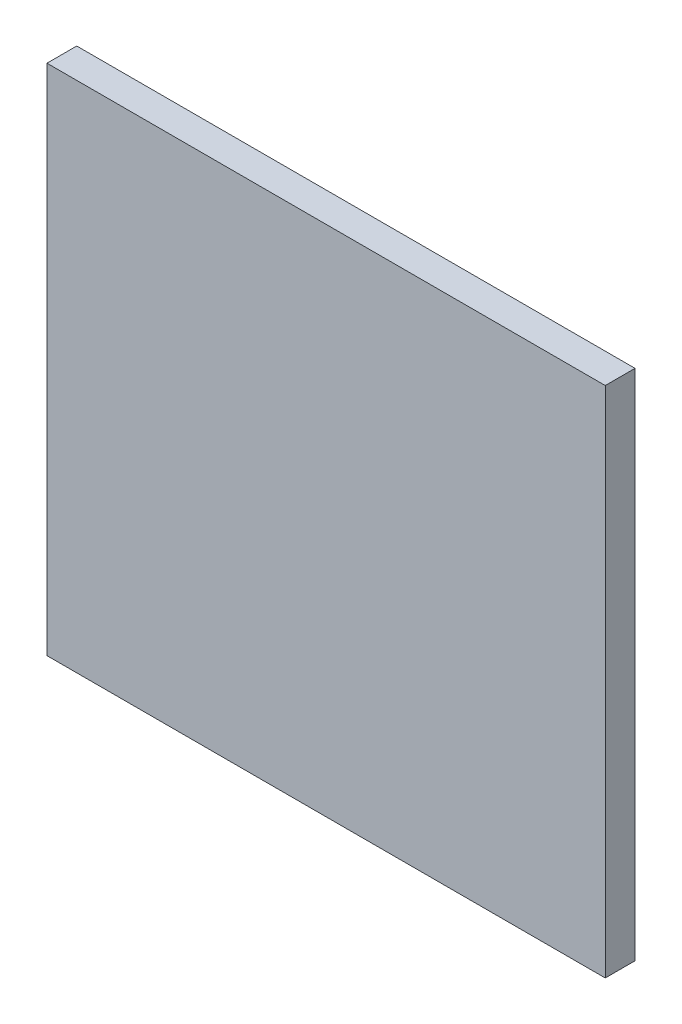
ISO-10303-21;
HEADER;
FILE_DESCRIPTION(('STEP AP214'),'2;1');
FILE_NAME('part.step','',(''),(''),'','','');
FILE_SCHEMA(('AUTOMOTIVE_DESIGN { 1 0 10303 214 1 1 1 1 }'));
ENDSEC;
DATA;
#1=APPLICATION_CONTEXT('core data for automotive mechanical design processes');
#2=APPLICATION_PROTOCOL_DEFINITION('international standard','automotive_design',2000,#1);
#3=PRODUCT_CONTEXT('',#1,'mechanical');
#4=PRODUCT('Part','Part','',(#3));
#5=PRODUCT_RELATED_PRODUCT_CATEGORY('part','',(#4));
#6=PRODUCT_DEFINITION_FORMATION('','',#4);
#7=PRODUCT_DEFINITION_CONTEXT('part definition',#1,'design');
#8=PRODUCT_DEFINITION('design','',#6,#7);
#9=PRODUCT_DEFINITION_SHAPE('','',#8);
#10=(LENGTH_UNIT() NAMED_UNIT(*) SI_UNIT(.MILLI.,.METRE.));
#11=(NAMED_UNIT(*) PLANE_ANGLE_UNIT() SI_UNIT($,.RADIAN.));
#12=(NAMED_UNIT(*) SI_UNIT($,.STERADIAN.) SOLID_ANGLE_UNIT());
#13=UNCERTAINTY_MEASURE_WITH_UNIT(LENGTH_MEASURE(1.E-05),#10,'distance_accuracy_value','');
#14=(GEOMETRIC_REPRESENTATION_CONTEXT(3) GLOBAL_UNCERTAINTY_ASSIGNED_CONTEXT((#13)) GLOBAL_UNIT_ASSIGNED_CONTEXT((#10,
#11,#12)) REPRESENTATION_CONTEXT('',''));
#15=CARTESIAN_POINT('',(0.,0.,0.));
#16=DIRECTION('',(0.,0.,1.));
#17=DIRECTION('',(1.,0.,0.));
#18=AXIS2_PLACEMENT_3D('',#15,#16,#17);
#19=CARTESIAN_POINT('',(-0.60000388,0.55144416,0.06399784));
#20=DIRECTION('',(0.,0.,-1.));
#21=DIRECTION('',(-1.,0.,0.));
#22=AXIS2_PLACEMENT_3D('',#19,#20,#21);
#23=PLANE('',#22);
#24=DIRECTION('',(1.,0.,0.));
#25=VECTOR('',#24,1.);
#26=CARTESIAN_POINT('',(-0.60000388,-0.55144162,0.06399784));
#27=LINE('',#26,#25);
#28=CARTESIAN_POINT('',(-0.60000388,-0.55144162,0.06399784));
#29=VERTEX_POINT('',#28);
#30=CARTESIAN_POINT('',(0.60000388,-0.55144162,0.06399784));
#31=VERTEX_POINT('',#30);
#32=EDGE_CURVE('E54',#29,#31,#27,.T.);
#33=ORIENTED_EDGE('',*,*,#32,.T.);
#34=DIRECTION('',(0.,1.,0.));
#35=VECTOR('',#34,1.);
#36=CARTESIAN_POINT('',(0.60000388,-0.55144162,0.06399784));
#37=LINE('',#36,#35);
#38=CARTESIAN_POINT('',(0.60000388,0.55144416,0.06399784));
#39=VERTEX_POINT('',#38);
#40=EDGE_CURVE('E56',#31,#39,#37,.T.);
#41=ORIENTED_EDGE('',*,*,#40,.T.);
#42=DIRECTION('',(1.,0.,0.));
#43=VECTOR('',#42,1.);
#44=CARTESIAN_POINT('',(0.60000388,0.55144416,0.06399784));
#45=LINE('',#44,#43);
#46=CARTESIAN_POINT('',(-0.60000388,0.55144416,0.06399784));
#47=VERTEX_POINT('',#46);
#48=EDGE_CURVE('E19',#39,#47,#45,.F.);
#49=ORIENTED_EDGE('',*,*,#48,.T.);
#50=DIRECTION('',(0.,1.,0.));
#51=VECTOR('',#50,1.);
#52=CARTESIAN_POINT('',(-0.60000388,0.55144416,0.06399784));
#53=LINE('',#52,#51);
#54=EDGE_CURVE('E79',#47,#29,#53,.F.);
#55=ORIENTED_EDGE('',*,*,#54,.T.);
#56=EDGE_LOOP('',(#33,#41,#49,#55));
#57=FACE_BOUND('',#56,.T.);
#58=ADVANCED_FACE('F16',(#57),#23,.F.);
#59=CARTESIAN_POINT('',(0.60000388,0.55144416,0.));
#60=DIRECTION('',(0.,-1.,0.));
#61=DIRECTION('',(0.,0.,-1.));
#62=AXIS2_PLACEMENT_3D('',#59,#60,#61);
#63=PLANE('',#62);
#64=DIRECTION('',(0.,0.,-1.));
#65=VECTOR('',#64,1.);
#66=CARTESIAN_POINT('',(-0.60000388,0.55144416,0.));
#67=LINE('',#66,#65);
#68=CARTESIAN_POINT('',(-0.60000388,0.55144416,0.));
#69=VERTEX_POINT('',#68);
#70=EDGE_CURVE('E67',#69,#47,#67,.F.);
#71=ORIENTED_EDGE('',*,*,#70,.T.);
#72=ORIENTED_EDGE('',*,*,#48,.F.);
#73=DIRECTION('',(0.,0.,1.));
#74=VECTOR('',#73,1.);
#75=CARTESIAN_POINT('',(0.60000388,0.55144416,0.));
#76=LINE('',#75,#74);
#77=CARTESIAN_POINT('',(0.60000388,0.55144416,0.));
#78=VERTEX_POINT('',#77);
#79=EDGE_CURVE('E62',#39,#78,#76,.F.);
#80=ORIENTED_EDGE('',*,*,#79,.T.);
#81=DIRECTION('',(-1.,0.,0.));
#82=VECTOR('',#81,1.);
#83=CARTESIAN_POINT('',(-0.60000388,0.55144416,0.));
#84=LINE('',#83,#82);
#85=EDGE_CURVE('E82',#69,#78,#84,.F.);
#86=ORIENTED_EDGE('',*,*,#85,.F.);
#87=EDGE_LOOP('',(#71,#72,#80,#86));
#88=FACE_BOUND('',#87,.T.);
#89=ADVANCED_FACE('F64',(#88),#63,.F.);
#90=CARTESIAN_POINT('',(0.60000388,-0.55144162,0.));
#91=DIRECTION('',(-1.,0.,0.));
#92=DIRECTION('',(0.,0.,1.));
#93=AXIS2_PLACEMENT_3D('',#90,#91,#92);
#94=PLANE('',#93);
#95=ORIENTED_EDGE('',*,*,#79,.F.);
#96=ORIENTED_EDGE('',*,*,#40,.F.);
#97=DIRECTION('',(0.,0.,1.));
#98=VECTOR('',#97,1.);
#99=CARTESIAN_POINT('',(0.60000388,-0.55144162,0.));
#100=LINE('',#99,#98);
#101=CARTESIAN_POINT('',(0.60000388,-0.55144162,0.));
#102=VERTEX_POINT('',#101);
#103=EDGE_CURVE('E74',#31,#102,#100,.F.);
#104=ORIENTED_EDGE('',*,*,#103,.T.);
#105=DIRECTION('',(0.,1.,0.));
#106=VECTOR('',#105,1.);
#107=CARTESIAN_POINT('',(0.60000388,0.55144416,0.));
#108=LINE('',#107,#106);
#109=EDGE_CURVE('E71',#78,#102,#108,.F.);
#110=ORIENTED_EDGE('',*,*,#109,.F.);
#111=EDGE_LOOP('',(#95,#96,#104,#110));
#112=FACE_BOUND('',#111,.T.);
#113=ADVANCED_FACE('F69',(#112),#94,.F.);
#114=CARTESIAN_POINT('',(-0.60000388,-0.55144162,0.));
#115=DIRECTION('',(0.,1.,0.));
#116=DIRECTION('',(0.,0.,1.));
#117=AXIS2_PLACEMENT_3D('',#114,#115,#116);
#118=PLANE('',#117);
#119=ORIENTED_EDGE('',*,*,#103,.F.);
#120=ORIENTED_EDGE('',*,*,#32,.F.);
#121=DIRECTION('',(0.,0.,-1.));
#122=VECTOR('',#121,1.);
#123=CARTESIAN_POINT('',(-0.60000388,-0.55144162,0.));
#124=LINE('',#123,#122);
#125=CARTESIAN_POINT('',(-0.60000388,-0.55144162,0.));
#126=VERTEX_POINT('',#125);
#127=EDGE_CURVE('E34',#29,#126,#124,.T.);
#128=ORIENTED_EDGE('',*,*,#127,.T.);
#129=DIRECTION('',(-1.,0.,0.));
#130=VECTOR('',#129,1.);
#131=CARTESIAN_POINT('',(-0.60000388,-0.55144162,0.));
#132=LINE('',#131,#130);
#133=EDGE_CURVE('E25',#102,#126,#132,.T.);
#134=ORIENTED_EDGE('',*,*,#133,.F.);
#135=EDGE_LOOP('',(#119,#120,#128,#134));
#136=FACE_BOUND('',#135,.T.);
#137=ADVANCED_FACE('F88',(#136),#118,.F.);
#138=CARTESIAN_POINT('',(-0.60000388,0.55144416,0.));
#139=DIRECTION('',(1.,0.,0.));
#140=DIRECTION('',(0.,0.,-1.));
#141=AXIS2_PLACEMENT_3D('',#138,#139,#140);
#142=PLANE('',#141);
#143=ORIENTED_EDGE('',*,*,#127,.F.);
#144=ORIENTED_EDGE('',*,*,#54,.F.);
#145=ORIENTED_EDGE('',*,*,#70,.F.);
#146=DIRECTION('',(0.,1.,0.));
#147=VECTOR('',#146,1.);
#148=CARTESIAN_POINT('',(-0.60000388,0.55144416,0.));
#149=LINE('',#148,#147);
#150=EDGE_CURVE('E11',#126,#69,#149,.T.);
#151=ORIENTED_EDGE('',*,*,#150,.F.);
#152=EDGE_LOOP('',(#143,#144,#145,#151));
#153=FACE_BOUND('',#152,.T.);
#154=ADVANCED_FACE('F90',(#153),#142,.F.);
#155=CARTESIAN_POINT('',(-0.60000388,0.55144416,0.));
#156=DIRECTION('',(0.,0.,-1.));
#157=DIRECTION('',(-1.,0.,0.));
#158=AXIS2_PLACEMENT_3D('',#155,#156,#157);
#159=PLANE('',#158);
#160=ORIENTED_EDGE('',*,*,#133,.T.);
#161=ORIENTED_EDGE('',*,*,#150,.T.);
#162=ORIENTED_EDGE('',*,*,#85,.T.);
#163=ORIENTED_EDGE('',*,*,#109,.T.);
#164=EDGE_LOOP('',(#160,#161,#162,#163));
#165=FACE_BOUND('',#164,.T.);
#166=ADVANCED_FACE('F87',(#165),#159,.T.);
#167=CLOSED_SHELL('',(#58,#89,#113,#137,#154,#166));
#168=MANIFOLD_SOLID_BREP('B1',#167);
#169=ADVANCED_BREP_SHAPE_REPRESENTATION('',(#18,#168),#14);
#170=SHAPE_DEFINITION_REPRESENTATION(#9,#169);
ENDSEC;
END-ISO-10303-21;
